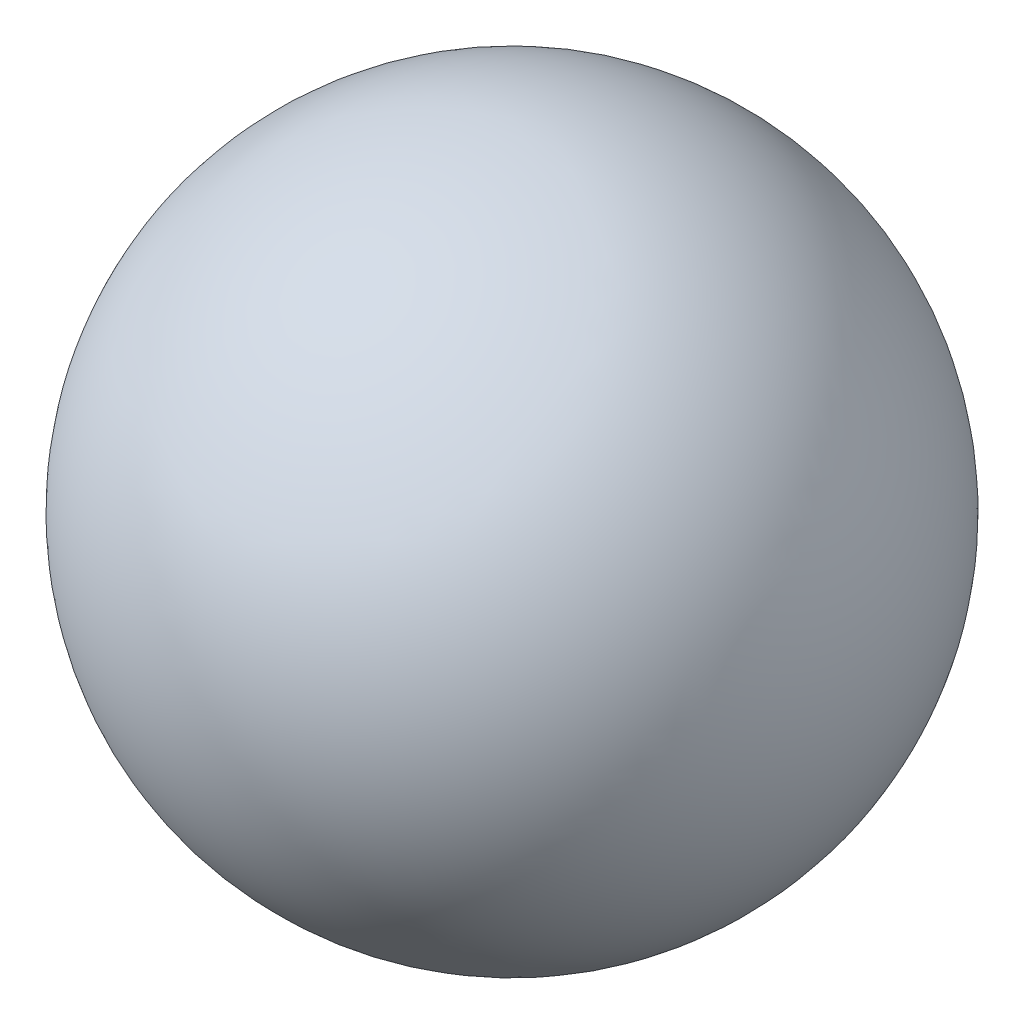
ISO-10303-21;
HEADER;
FILE_DESCRIPTION(('STEP AP214'),'2;1');
FILE_NAME('part.step','',(''),(''),'','','');
FILE_SCHEMA(('AUTOMOTIVE_DESIGN { 1 0 10303 214 1 1 1 1 }'));
ENDSEC;
DATA;
#1=APPLICATION_CONTEXT('core data for automotive mechanical design processes');
#2=APPLICATION_PROTOCOL_DEFINITION('international standard','automotive_design',2000,#1);
#3=PRODUCT_CONTEXT('',#1,'mechanical');
#4=PRODUCT('Part','Part','',(#3));
#5=PRODUCT_RELATED_PRODUCT_CATEGORY('part','',(#4));
#6=PRODUCT_DEFINITION_FORMATION('','',#4);
#7=PRODUCT_DEFINITION_CONTEXT('part definition',#1,'design');
#8=PRODUCT_DEFINITION('design','',#6,#7);
#9=PRODUCT_DEFINITION_SHAPE('','',#8);
#10=(LENGTH_UNIT() NAMED_UNIT(*) SI_UNIT(.MILLI.,.METRE.));
#11=(NAMED_UNIT(*) PLANE_ANGLE_UNIT() SI_UNIT($,.RADIAN.));
#12=(NAMED_UNIT(*) SI_UNIT($,.STERADIAN.) SOLID_ANGLE_UNIT());
#13=UNCERTAINTY_MEASURE_WITH_UNIT(LENGTH_MEASURE(1.E-05),#10,'distance_accuracy_value','');
#14=(GEOMETRIC_REPRESENTATION_CONTEXT(3) GLOBAL_UNCERTAINTY_ASSIGNED_CONTEXT((#13)) GLOBAL_UNIT_ASSIGNED_CONTEXT((#10,
#11,#12)) REPRESENTATION_CONTEXT('',''));
#15=CARTESIAN_POINT('',(0.,0.,0.));
#16=DIRECTION('',(0.,0.,1.));
#17=DIRECTION('',(1.,0.,0.));
#18=AXIS2_PLACEMENT_3D('',#15,#16,#17);
#19=CARTESIAN_POINT('',(0.,0.,0.));
#20=DIRECTION('',(-1.,0.,0.));
#21=DIRECTION('',(0.,0.,-1.));
#22=AXIS2_PLACEMENT_3D('',#19,#20,#21);
#23=SPHERICAL_SURFACE('',#22,47.625);
#24=CARTESIAN_POINT('',(-47.625,0.,0.));
#25=VERTEX_POINT('',#24);
#26=VERTEX_LOOP('',#25);
#27=FACE_BOUND('',#26,.T.);
#28=ADVANCED_FACE('F29',(#27),#23,.T.);
#29=CLOSED_SHELL('',(#28));
#30=MANIFOLD_SOLID_BREP('B2',#29);
#31=ADVANCED_BREP_SHAPE_REPRESENTATION('',(#18,#30),#14);
#32=SHAPE_DEFINITION_REPRESENTATION(#9,#31);
ENDSEC;
END-ISO-10303-21;
